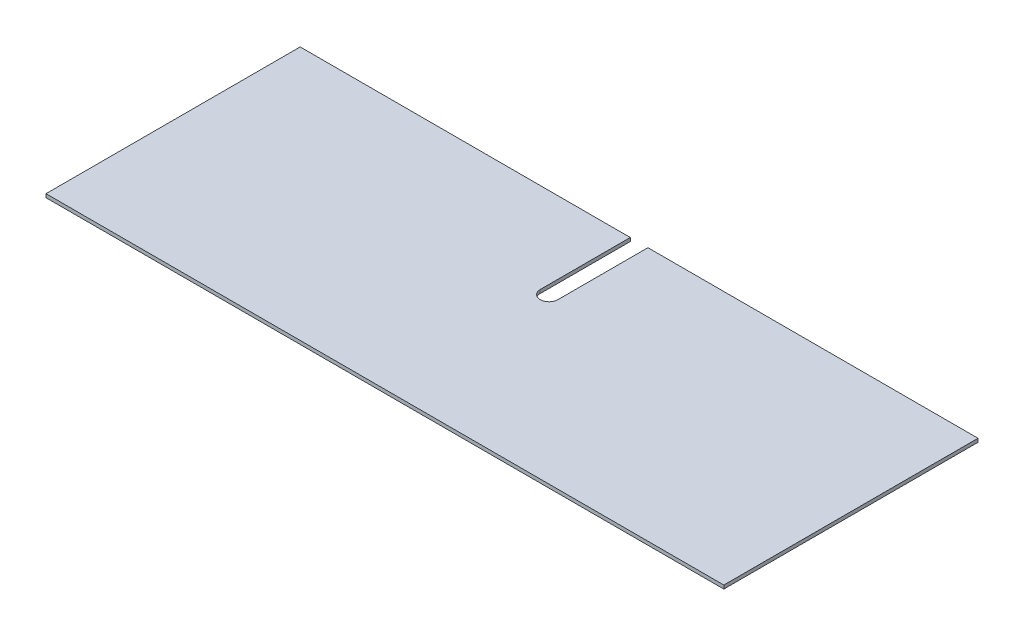
ISO-10303-21;
HEADER;
FILE_DESCRIPTION(('STEP AP214'),'2;1');
FILE_NAME('part.step','',(''),(''),'','','');
FILE_SCHEMA(('AUTOMOTIVE_DESIGN { 1 0 10303 214 1 1 1 1 }'));
ENDSEC;
DATA;
#1=APPLICATION_CONTEXT('core data for automotive mechanical design processes');
#2=APPLICATION_PROTOCOL_DEFINITION('international standard','automotive_design',2000,#1);
#3=PRODUCT_CONTEXT('',#1,'mechanical');
#4=PRODUCT('Part','Part','',(#3));
#5=PRODUCT_RELATED_PRODUCT_CATEGORY('part','',(#4));
#6=PRODUCT_DEFINITION_FORMATION('','',#4);
#7=PRODUCT_DEFINITION_CONTEXT('part definition',#1,'design');
#8=PRODUCT_DEFINITION('design','',#6,#7);
#9=PRODUCT_DEFINITION_SHAPE('','',#8);
#10=(LENGTH_UNIT() NAMED_UNIT(*) SI_UNIT(.MILLI.,.METRE.));
#11=(NAMED_UNIT(*) PLANE_ANGLE_UNIT() SI_UNIT($,.RADIAN.));
#12=(NAMED_UNIT(*) SI_UNIT($,.STERADIAN.) SOLID_ANGLE_UNIT());
#13=UNCERTAINTY_MEASURE_WITH_UNIT(LENGTH_MEASURE(1.E-05),#10,'distance_accuracy_value','');
#14=(GEOMETRIC_REPRESENTATION_CONTEXT(3) GLOBAL_UNCERTAINTY_ASSIGNED_CONTEXT((#13)) GLOBAL_UNIT_ASSIGNED_CONTEXT((#10,
#11,#12)) REPRESENTATION_CONTEXT('',''));
#15=CARTESIAN_POINT('',(0.,0.,0.));
#16=DIRECTION('',(0.,0.,1.));
#17=DIRECTION('',(1.,0.,0.));
#18=AXIS2_PLACEMENT_3D('',#15,#16,#17);
#19=CARTESIAN_POINT('',(0.,3.175,0.));
#20=DIRECTION('',(0.,1.,0.));
#21=DIRECTION('',(0.,0.,1.));
#22=AXIS2_PLACEMENT_3D('',#19,#20,#21);
#23=PLANE('',#22);
#24=CARTESIAN_POINT('',(0.,3.175,-33.3375));
#25=DIRECTION('',(0.,1.,0.));
#26=DIRECTION('',(0.,0.,1.));
#27=AXIS2_PLACEMENT_3D('',#24,#25,#26);
#28=CIRCLE('',#27,7.9375);
#29=CARTESIAN_POINT('',(7.9375,3.175,-33.3375));
#30=VERTEX_POINT('',#29);
#31=CARTESIAN_POINT('',(-7.9375,3.175,-33.3375));
#32=VERTEX_POINT('',#31);
#33=EDGE_CURVE('E20',#30,#32,#28,.F.);
#34=ORIENTED_EDGE('',*,*,#33,.T.);
#35=DIRECTION('',(0.,0.,1.));
#36=VECTOR('',#35,1.);
#37=CARTESIAN_POINT('',(-7.9375,3.175,-114.3));
#38=LINE('',#37,#36);
#39=CARTESIAN_POINT('',(-7.93749999999999,3.175,-114.3));
#40=VERTEX_POINT('',#39);
#41=EDGE_CURVE('E58',#32,#40,#38,.F.);
#42=ORIENTED_EDGE('',*,*,#41,.T.);
#43=DIRECTION('',(-1.,0.,0.));
#44=VECTOR('',#43,1.);
#45=CARTESIAN_POINT('',(304.8,3.175,-114.3));
#46=LINE('',#45,#44);
#47=CARTESIAN_POINT('',(-304.8,3.175,-114.3));
#48=VERTEX_POINT('',#47);
#49=EDGE_CURVE('E94',#48,#40,#46,.F.);
#50=ORIENTED_EDGE('',*,*,#49,.F.);
#51=DIRECTION('',(0.,0.,1.));
#52=VECTOR('',#51,1.);
#53=CARTESIAN_POINT('',(-304.8,3.175,-114.3));
#54=LINE('',#53,#52);
#55=CARTESIAN_POINT('',(-304.8,3.175,114.3));
#56=VERTEX_POINT('',#55);
#57=EDGE_CURVE('E89',#56,#48,#54,.F.);
#58=ORIENTED_EDGE('',*,*,#57,.F.);
#59=DIRECTION('',(1.,0.,0.));
#60=VECTOR('',#59,1.);
#61=CARTESIAN_POINT('',(-304.8,3.175,114.3));
#62=LINE('',#61,#60);
#63=CARTESIAN_POINT('',(304.8,3.175,114.3));
#64=VERTEX_POINT('',#63);
#65=EDGE_CURVE('E130',#64,#56,#62,.F.);
#66=ORIENTED_EDGE('',*,*,#65,.F.);
#67=DIRECTION('',(0.,0.,-1.));
#68=VECTOR('',#67,1.);
#69=CARTESIAN_POINT('',(304.8,3.175,114.3));
#70=LINE('',#69,#68);
#71=CARTESIAN_POINT('',(304.8,3.175,-114.3));
#72=VERTEX_POINT('',#71);
#73=EDGE_CURVE('E125',#72,#64,#70,.F.);
#74=ORIENTED_EDGE('',*,*,#73,.F.);
#75=DIRECTION('',(-1.,0.,0.));
#76=VECTOR('',#75,1.);
#77=CARTESIAN_POINT('',(304.8,3.175,-114.3));
#78=LINE('',#77,#76);
#79=CARTESIAN_POINT('',(7.93749999999999,3.175,-114.3));
#80=VERTEX_POINT('',#79);
#81=EDGE_CURVE('E64',#80,#72,#78,.F.);
#82=ORIENTED_EDGE('',*,*,#81,.F.);
#83=DIRECTION('',(0.,0.,-1.));
#84=VECTOR('',#83,1.);
#85=CARTESIAN_POINT('',(7.9375,3.175,-33.3375));
#86=LINE('',#85,#84);
#87=EDGE_CURVE('E51',#80,#30,#86,.F.);
#88=ORIENTED_EDGE('',*,*,#87,.T.);
#89=EDGE_LOOP('',(#34,#42,#50,#58,#66,#74,#82,#88));
#90=FACE_BOUND('',#89,.T.);
#91=ADVANCED_FACE('F17',(#90),#23,.T.);
#92=CARTESIAN_POINT('',(-7.9375,3.175,-114.3));
#93=DIRECTION('',(-1.,0.,0.));
#94=DIRECTION('',(0.,0.,1.));
#95=AXIS2_PLACEMENT_3D('',#92,#93,#94);
#96=PLANE('',#95);
#97=ORIENTED_EDGE('',*,*,#41,.F.);
#98=DIRECTION('',(0.,1.,0.));
#99=VECTOR('',#98,1.);
#100=CARTESIAN_POINT('',(-7.9375,3.175,-33.3375));
#101=LINE('',#100,#99);
#102=CARTESIAN_POINT('',(-7.9375,0.,-33.3375));
#103=VERTEX_POINT('',#102);
#104=EDGE_CURVE('E114',#32,#103,#101,.F.);
#105=ORIENTED_EDGE('',*,*,#104,.T.);
#106=DIRECTION('',(0.,0.,1.));
#107=VECTOR('',#106,1.);
#108=CARTESIAN_POINT('',(-7.9375,0.,0.));
#109=LINE('',#108,#107);
#110=CARTESIAN_POINT('',(-7.93749999999999,0.,-114.3));
#111=VERTEX_POINT('',#110);
#112=EDGE_CURVE('E104',#103,#111,#109,.F.);
#113=ORIENTED_EDGE('',*,*,#112,.T.);
#114=DIRECTION('',(0.,1.,0.));
#115=VECTOR('',#114,1.);
#116=CARTESIAN_POINT('',(-7.93749999999999,0.,-114.3));
#117=LINE('',#116,#115);
#118=EDGE_CURVE('E97',#40,#111,#117,.F.);
#119=ORIENTED_EDGE('',*,*,#118,.F.);
#120=EDGE_LOOP('',(#97,#105,#113,#119));
#121=FACE_BOUND('',#120,.T.);
#122=ADVANCED_FACE('F103',(#121),#96,.F.);
#123=CARTESIAN_POINT('',(304.8,0.,-114.3));
#124=DIRECTION('',(0.,0.,-1.));
#125=DIRECTION('',(-1.,0.,0.));
#126=AXIS2_PLACEMENT_3D('',#123,#124,#125);
#127=PLANE('',#126);
#128=ORIENTED_EDGE('',*,*,#49,.T.);
#129=ORIENTED_EDGE('',*,*,#118,.T.);
#130=DIRECTION('',(1.,0.,0.));
#131=VECTOR('',#130,1.);
#132=CARTESIAN_POINT('',(0.,0.,-114.3));
#133=LINE('',#132,#131);
#134=CARTESIAN_POINT('',(-304.8,0.,-114.3));
#135=VERTEX_POINT('',#134);
#136=EDGE_CURVE('E149',#111,#135,#133,.F.);
#137=ORIENTED_EDGE('',*,*,#136,.T.);
#138=DIRECTION('',(0.,1.,0.));
#139=VECTOR('',#138,1.);
#140=CARTESIAN_POINT('',(-304.8,0.,-114.3));
#141=LINE('',#140,#139);
#142=EDGE_CURVE('E99',#48,#135,#141,.F.);
#143=ORIENTED_EDGE('',*,*,#142,.F.);
#144=EDGE_LOOP('',(#128,#129,#137,#143));
#145=FACE_BOUND('',#144,.T.);
#146=ADVANCED_FACE('F95',(#145),#127,.T.);
#147=CARTESIAN_POINT('',(-304.8,0.,-114.3));
#148=DIRECTION('',(-1.,0.,0.));
#149=DIRECTION('',(0.,0.,1.));
#150=AXIS2_PLACEMENT_3D('',#147,#148,#149);
#151=PLANE('',#150);
#152=ORIENTED_EDGE('',*,*,#142,.T.);
#153=DIRECTION('',(0.,0.,1.));
#154=VECTOR('',#153,1.);
#155=CARTESIAN_POINT('',(-304.8,0.,0.));
#156=LINE('',#155,#154);
#157=CARTESIAN_POINT('',(-304.8,0.,114.3));
#158=VERTEX_POINT('',#157);
#159=EDGE_CURVE('E150',#135,#158,#156,.T.);
#160=ORIENTED_EDGE('',*,*,#159,.T.);
#161=DIRECTION('',(0.,1.,0.));
#162=VECTOR('',#161,1.);
#163=CARTESIAN_POINT('',(-304.8,0.,114.3));
#164=LINE('',#163,#162);
#165=EDGE_CURVE('E127',#56,#158,#164,.F.);
#166=ORIENTED_EDGE('',*,*,#165,.F.);
#167=ORIENTED_EDGE('',*,*,#57,.T.);
#168=EDGE_LOOP('',(#152,#160,#166,#167));
#169=FACE_BOUND('',#168,.T.);
#170=ADVANCED_FACE('F194',(#169),#151,.T.);
#171=CARTESIAN_POINT('',(-304.8,0.,114.3));
#172=DIRECTION('',(0.,0.,1.));
#173=DIRECTION('',(1.,0.,0.));
#174=AXIS2_PLACEMENT_3D('',#171,#172,#173);
#175=PLANE('',#174);
#176=ORIENTED_EDGE('',*,*,#165,.T.);
#177=DIRECTION('',(1.,0.,0.));
#178=VECTOR('',#177,1.);
#179=CARTESIAN_POINT('',(0.,0.,114.3));
#180=LINE('',#179,#178);
#181=CARTESIAN_POINT('',(304.8,0.,114.3));
#182=VERTEX_POINT('',#181);
#183=EDGE_CURVE('E151',#158,#182,#180,.T.);
#184=ORIENTED_EDGE('',*,*,#183,.T.);
#185=DIRECTION('',(0.,1.,0.));
#186=VECTOR('',#185,1.);
#187=CARTESIAN_POINT('',(304.8,0.,114.3));
#188=LINE('',#187,#186);
#189=EDGE_CURVE('E122',#64,#182,#188,.F.);
#190=ORIENTED_EDGE('',*,*,#189,.F.);
#191=ORIENTED_EDGE('',*,*,#65,.T.);
#192=EDGE_LOOP('',(#176,#184,#190,#191));
#193=FACE_BOUND('',#192,.T.);
#194=ADVANCED_FACE('F188',(#193),#175,.T.);
#195=CARTESIAN_POINT('',(304.8,0.,114.3));
#196=DIRECTION('',(1.,0.,0.));
#197=DIRECTION('',(0.,0.,-1.));
#198=AXIS2_PLACEMENT_3D('',#195,#196,#197);
#199=PLANE('',#198);
#200=ORIENTED_EDGE('',*,*,#189,.T.);
#201=DIRECTION('',(0.,0.,1.));
#202=VECTOR('',#201,1.);
#203=CARTESIAN_POINT('',(304.8,0.,0.));
#204=LINE('',#203,#202);
#205=CARTESIAN_POINT('',(304.8,0.,-114.3));
#206=VERTEX_POINT('',#205);
#207=EDGE_CURVE('E168',#182,#206,#204,.F.);
#208=ORIENTED_EDGE('',*,*,#207,.T.);
#209=DIRECTION('',(0.,1.,0.));
#210=VECTOR('',#209,1.);
#211=CARTESIAN_POINT('',(304.8,0.,-114.3));
#212=LINE('',#211,#210);
#213=EDGE_CURVE('E121',#72,#206,#212,.F.);
#214=ORIENTED_EDGE('',*,*,#213,.F.);
#215=ORIENTED_EDGE('',*,*,#73,.T.);
#216=EDGE_LOOP('',(#200,#208,#214,#215));
#217=FACE_BOUND('',#216,.T.);
#218=ADVANCED_FACE('F202',(#217),#199,.T.);
#219=CARTESIAN_POINT('',(304.8,0.,-114.3));
#220=DIRECTION('',(0.,0.,-1.));
#221=DIRECTION('',(-1.,0.,0.));
#222=AXIS2_PLACEMENT_3D('',#219,#220,#221);
#223=PLANE('',#222);
#224=DIRECTION('',(1.,0.,0.));
#225=VECTOR('',#224,1.);
#226=CARTESIAN_POINT('',(0.,0.,-114.3));
#227=LINE('',#226,#225);
#228=CARTESIAN_POINT('',(7.9375,0.,-114.3));
#229=VERTEX_POINT('',#228);
#230=EDGE_CURVE('E165',#206,#229,#227,.F.);
#231=ORIENTED_EDGE('',*,*,#230,.T.);
#232=DIRECTION('',(0.,1.,0.));
#233=VECTOR('',#232,1.);
#234=CARTESIAN_POINT('',(7.9375,3.175,-114.3));
#235=LINE('',#234,#233);
#236=EDGE_CURVE('E115',#229,#80,#235,.T.);
#237=ORIENTED_EDGE('',*,*,#236,.T.);
#238=ORIENTED_EDGE('',*,*,#81,.T.);
#239=ORIENTED_EDGE('',*,*,#213,.T.);
#240=EDGE_LOOP('',(#231,#237,#238,#239));
#241=FACE_BOUND('',#240,.T.);
#242=ADVANCED_FACE('F216',(#241),#223,.T.);
#243=CARTESIAN_POINT('',(7.9375,3.175,-33.3375));
#244=DIRECTION('',(1.,0.,0.));
#245=DIRECTION('',(0.,0.,-1.));
#246=AXIS2_PLACEMENT_3D('',#243,#244,#245);
#247=PLANE('',#246);
#248=ORIENTED_EDGE('',*,*,#87,.F.);
#249=ORIENTED_EDGE('',*,*,#236,.F.);
#250=DIRECTION('',(0.,0.,1.));
#251=VECTOR('',#250,1.);
#252=CARTESIAN_POINT('',(7.9375,0.,0.));
#253=LINE('',#252,#251);
#254=CARTESIAN_POINT('',(7.9375,0.,-33.3375));
#255=VERTEX_POINT('',#254);
#256=EDGE_CURVE('E26',#229,#255,#253,.T.);
#257=ORIENTED_EDGE('',*,*,#256,.T.);
#258=DIRECTION('',(0.,1.,0.));
#259=VECTOR('',#258,1.);
#260=CARTESIAN_POINT('',(7.9375,3.175,-33.3375));
#261=LINE('',#260,#259);
#262=EDGE_CURVE('E33',#255,#30,#261,.T.);
#263=ORIENTED_EDGE('',*,*,#262,.T.);
#264=EDGE_LOOP('',(#248,#249,#257,#263));
#265=FACE_BOUND('',#264,.T.);
#266=ADVANCED_FACE('F211',(#265),#247,.F.);
#267=CARTESIAN_POINT('',(0.,3.175,-33.3375));
#268=DIRECTION('',(0.,1.,0.));
#269=DIRECTION('',(0.,0.,1.));
#270=AXIS2_PLACEMENT_3D('',#267,#268,#269);
#271=CYLINDRICAL_SURFACE('',#270,7.9375);
#272=ORIENTED_EDGE('',*,*,#262,.F.);
#273=CARTESIAN_POINT('',(0.,0.,-33.3375));
#274=DIRECTION('',(0.,1.,0.));
#275=DIRECTION('',(0.,0.,1.));
#276=AXIS2_PLACEMENT_3D('',#273,#274,#275);
#277=CIRCLE('',#276,7.9375);
#278=EDGE_CURVE('E11',#255,#103,#277,.F.);
#279=ORIENTED_EDGE('',*,*,#278,.T.);
#280=ORIENTED_EDGE('',*,*,#104,.F.);
#281=ORIENTED_EDGE('',*,*,#33,.F.);
#282=EDGE_LOOP('',(#272,#279,#280,#281));
#283=FACE_BOUND('',#282,.T.);
#284=ADVANCED_FACE('F206',(#283),#271,.F.);
#285=CARTESIAN_POINT('',(0.,0.,0.));
#286=DIRECTION('',(0.,1.,0.));
#287=DIRECTION('',(0.,0.,1.));
#288=AXIS2_PLACEMENT_3D('',#285,#286,#287);
#289=PLANE('',#288);
#290=ORIENTED_EDGE('',*,*,#256,.F.);
#291=ORIENTED_EDGE('',*,*,#230,.F.);
#292=ORIENTED_EDGE('',*,*,#207,.F.);
#293=ORIENTED_EDGE('',*,*,#183,.F.);
#294=ORIENTED_EDGE('',*,*,#159,.F.);
#295=ORIENTED_EDGE('',*,*,#136,.F.);
#296=ORIENTED_EDGE('',*,*,#112,.F.);
#297=ORIENTED_EDGE('',*,*,#278,.F.);
#298=EDGE_LOOP('',(#290,#291,#292,#293,#294,#295,#296,#297));
#299=FACE_BOUND('',#298,.T.);
#300=ADVANCED_FACE('F192',(#299),#289,.F.);
#301=CLOSED_SHELL('',(#91,#122,#146,#170,#194,#218,#242,#266,#284,#300));
#302=MANIFOLD_SOLID_BREP('B1',#301);
#303=ADVANCED_BREP_SHAPE_REPRESENTATION('',(#18,#302),#14);
#304=SHAPE_DEFINITION_REPRESENTATION(#9,#303);
ENDSEC;
END-ISO-10303-21;
